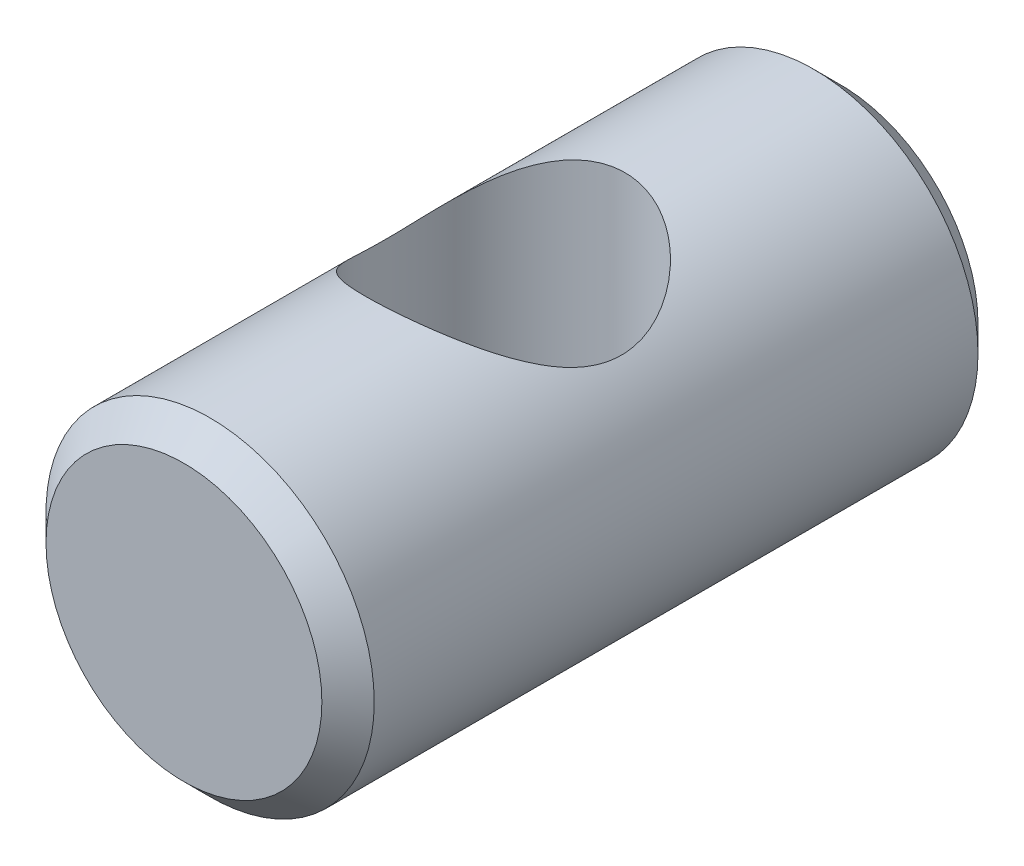
ISO-10303-21;
HEADER;
FILE_DESCRIPTION(('STEP AP214'),'2;1');
FILE_NAME('part.step','',(''),(''),'','','');
FILE_SCHEMA(('AUTOMOTIVE_DESIGN { 1 0 10303 214 1 1 1 1 }'));
ENDSEC;
DATA;
#1=APPLICATION_CONTEXT('core data for automotive mechanical design processes');
#2=APPLICATION_PROTOCOL_DEFINITION('international standard','automotive_design',2000,#1);
#3=PRODUCT_CONTEXT('',#1,'mechanical');
#4=PRODUCT('Part','Part','',(#3));
#5=PRODUCT_RELATED_PRODUCT_CATEGORY('part','',(#4));
#6=PRODUCT_DEFINITION_FORMATION('','',#4);
#7=PRODUCT_DEFINITION_CONTEXT('part definition',#1,'design');
#8=PRODUCT_DEFINITION('design','',#6,#7);
#9=PRODUCT_DEFINITION_SHAPE('','',#8);
#10=(LENGTH_UNIT() NAMED_UNIT(*) SI_UNIT(.MILLI.,.METRE.));
#11=(NAMED_UNIT(*) PLANE_ANGLE_UNIT() SI_UNIT($,.RADIAN.));
#12=(NAMED_UNIT(*) SI_UNIT($,.STERADIAN.) SOLID_ANGLE_UNIT());
#13=UNCERTAINTY_MEASURE_WITH_UNIT(LENGTH_MEASURE(1.E-05),#10,'distance_accuracy_value','');
#14=(GEOMETRIC_REPRESENTATION_CONTEXT(3) GLOBAL_UNCERTAINTY_ASSIGNED_CONTEXT((#13)) GLOBAL_UNIT_ASSIGNED_CONTEXT((#10,
#11,#12)) REPRESENTATION_CONTEXT('',''));
#15=CARTESIAN_POINT('',(0.,0.,0.));
#16=DIRECTION('',(0.,0.,1.));
#17=DIRECTION('',(1.,0.,0.));
#18=AXIS2_PLACEMENT_3D('',#15,#16,#17);
#19=CARTESIAN_POINT('',(0.,0.,9.525));
#20=DIRECTION('',(0.,0.,-1.));
#21=DIRECTION('',(-1.,0.,0.));
#22=AXIS2_PLACEMENT_3D('',#19,#20,#21);
#23=CYLINDRICAL_SURFACE('',#22,4.765);
#24=CARTESIAN_POINT('',(0.,-4.765,-3.42087708051605));
#25=CARTESIAN_POINT('',(-0.0833627581168181,-4.76499971011089,-3.42696899134864));
#26=CARTESIAN_POINT('',(-0.166953392424251,-4.76280757869707,-3.43001003086424));
#27=CARTESIAN_POINT('',(-0.333933182408652,-4.75402028790231,-3.4299899120654));
#28=CARTESIAN_POINT('',(-0.41732223719261,-4.74742325494959,-3.42692615604904));
#29=CARTESIAN_POINT('',(-0.583312250165056,-4.72989865727235,-3.41478160746824));
#30=CARTESIAN_POINT('',(-0.665912068503747,-4.71896558414041,-3.40569315136156));
#31=CARTESIAN_POINT('',(-0.829610597514771,-4.69295834085159,-3.38168739143667));
#32=CARTESIAN_POINT('',(-0.91070865358331,-4.67788240819801,-3.36676760565251));
#33=CARTESIAN_POINT('',(-1.15000632689336,-4.62699847385246,-3.31382161536754));
#34=CARTESIAN_POINT('',(-1.30524951697123,-4.58542013528299,-3.26752778272676));
#35=CARTESIAN_POINT('',(-1.60411463212557,-4.48962808746058,-3.15544383432779));
#36=CARTESIAN_POINT('',(-1.74773682156028,-4.43541466574349,-3.08965416222603));
#37=CARTESIAN_POINT('',(-2.03259497643689,-4.31273538578719,-2.93522566350036));
#38=CARTESIAN_POINT('',(-2.17272279857911,-4.24347672491827,-2.84518090003159));
#39=CARTESIAN_POINT('',(-2.43631552731587,-4.09784606286129,-2.64803347355049));
#40=CARTESIAN_POINT('',(-2.55976291960052,-4.02146672501527,-2.54091313456509));
#41=CARTESIAN_POINT('',(-2.81327393100644,-3.84950291536883,-2.28757037498761));
#42=CARTESIAN_POINT('',(-2.93940806717613,-3.75321839663727,-2.13784494064544));
#43=CARTESIAN_POINT('',(-3.10885207016274,-3.61188607024724,-1.89774924473951));
#44=CARTESIAN_POINT('',(-3.16205944901992,-3.56527135977744,-1.81509327318893));
#45=CARTESIAN_POINT('',(-3.26165283895997,-3.47438917550769,-1.64456461914389));
#46=CARTESIAN_POINT('',(-3.30804141803447,-3.43012082209568,-1.55669391813204));
#47=CARTESIAN_POINT('',(-3.41144333221737,-3.32784018306176,-1.33801732923479));
#48=CARTESIAN_POINT('',(-3.46485738281701,-3.27176419567389,-1.20454764001565));
#49=CARTESIAN_POINT('',(-3.55539465585279,-3.1731532714438,-0.92756721927326));
#50=CARTESIAN_POINT('',(-3.59255605597934,-3.13058666617785,-0.784080947165174));
#51=CARTESIAN_POINT('',(-3.64343651296181,-3.07113542283653,-0.514646140223211));
#52=CARTESIAN_POINT('',(-3.66010628533956,-3.05107413064413,-0.389980532152305));
#53=CARTESIAN_POINT('',(-3.67954153570878,-3.02761567970702,-0.138051441971632));
#54=CARTESIAN_POINT('',(-3.68232117171679,-3.02420155283186,-0.0107907379518669));
#55=CARTESIAN_POINT('',(-3.67376621747767,-3.03458366659267,0.242449329866104));
#56=CARTESIAN_POINT('',(-3.66243797397314,-3.04837216824954,0.368429244158407));
#57=CARTESIAN_POINT('',(-3.62657095184853,-3.09094772918141,0.615927376424315));
#58=CARTESIAN_POINT('',(-3.60201250089043,-3.11975712134958,0.73743866171983));
#59=CARTESIAN_POINT('',(-3.52797021750045,-3.20358122773374,1.02486117239319));
#60=CARTESIAN_POINT('',(-3.47231020523667,-3.26453704351351,1.18741075414518));
#61=CARTESIAN_POINT('',(-3.34017866781708,-3.39961296516166,1.498121783823));
#62=CARTESIAN_POINT('',(-3.2636446149314,-3.47377238661047,1.64623815847782));
#63=CARTESIAN_POINT('',(-3.12200897105521,-3.60054284241464,1.87825971607124));
#64=CARTESIAN_POINT('',(-3.06234750531042,-3.65156363596668,1.9664324955114));
#65=CARTESIAN_POINT('',(-2.93536296354977,-3.75440484501344,2.13658829521523));
#66=CARTESIAN_POINT('',(-2.86803758566651,-3.80622549668557,2.21856944344932));
#67=CARTESIAN_POINT('',(-2.65493557738645,-3.96070606463684,2.4548169203279));
#68=CARTESIAN_POINT('',(-2.49782379852181,-4.06258137631192,2.59972905493882));
#69=CARTESIAN_POINT('',(-2.18575837138569,-4.23718725327564,2.83706621766583));
#70=CARTESIAN_POINT('',(-2.03548298499758,-4.31186637762032,2.93424360521689));
#71=CARTESIAN_POINT('',(-1.71702572980925,-4.44824656330391,3.10568912436017));
#72=CARTESIAN_POINT('',(-1.54887024912961,-4.50996636079322,3.17999040299218));
#73=CARTESIAN_POINT('',(-1.22389848309853,-4.60778480850806,3.29263516387729));
#74=CARTESIAN_POINT('',(-1.06910753325384,-4.64632732736096,3.33468022800881));
#75=CARTESIAN_POINT('',(-0.752190984217973,-4.70801774696666,3.39687013419293));
#76=CARTESIAN_POINT('',(-0.59006911276469,-4.73117337991453,3.4170259792185));
#77=CARTESIAN_POINT('',(-0.262598143568305,-4.7606051003247,3.43390286080124));
#78=CARTESIAN_POINT('',(-0.0972412962651665,-4.76683385814853,3.43055828056669));
#79=CARTESIAN_POINT('',(0.23102412935329,-4.76222706928004,3.40010195996678));
#80=CARTESIAN_POINT('',(0.393932420256083,-4.75138953488968,3.37298745129903));
#81=CARTESIAN_POINT('',(0.705514268669746,-4.71498049061455,3.2979508357131));
#82=CARTESIAN_POINT('',(0.854498752183592,-4.69006694126301,3.25098003249397));
#83=CARTESIAN_POINT('',(1.14256413370517,-4.62833634686259,3.13840780618742));
#84=CARTESIAN_POINT('',(1.28164310390504,-4.59151699239253,3.07280276883643));
#85=CARTESIAN_POINT('',(1.5605913242394,-4.50478911028579,2.91796402171938));
#86=CARTESIAN_POINT('',(1.6992420339739,-4.45396042558585,2.82706121692328));
#87=CARTESIAN_POINT('',(1.96045324775841,-4.34533105232053,2.62789389216064));
#88=CARTESIAN_POINT('',(2.08299871660834,-4.28752394420402,2.51961335554432));
#89=CARTESIAN_POINT('',(2.33061071233595,-4.15886196775128,2.26753986981795));
#90=CARTESIAN_POINT('',(2.45245602746959,-4.08747815085455,2.12084350362776));
#91=CARTESIAN_POINT('',(2.67091966387116,-3.94818744226299,1.80818256348861));
#92=CARTESIAN_POINT('',(2.76753692468301,-3.88028069682256,1.64221717999395));
#93=CARTESIAN_POINT('',(2.91829752704228,-3.76775877390235,1.32363316444147));
#94=CARTESIAN_POINT('',(2.97693831230802,-3.72114907301219,1.17388770573105));
#95=CARTESIAN_POINT('',(3.04915600293589,-3.66180847873486,0.941826581338295));
#96=CARTESIAN_POINT('',(3.07060089781089,-3.64379412637323,0.863255129060437));
#97=CARTESIAN_POINT('',(3.10797188341903,-3.61197174564401,0.703992654043791));
#98=CARTESIAN_POINT('',(3.12390068817333,-3.59816164910817,0.623302694735674));
#99=CARTESIAN_POINT('',(3.15010468685879,-3.57524455910332,0.459495462666018));
#100=CARTESIAN_POINT('',(3.16032158062367,-3.5661861203942,0.376361962516616));
#101=CARTESIAN_POINT('',(3.17464168800661,-3.55344451616001,0.209195138832913));
#102=CARTESIAN_POINT('',(3.17874788699032,-3.54975872585817,0.125162274904957));
#103=CARTESIAN_POINT('',(3.18076053743013,-3.54795587812489,-0.0430393452037649));
#104=CARTESIAN_POINT('',(3.17866722999483,-3.54983860412504,-0.127208095972434));
#105=CARTESIAN_POINT('',(3.16833758034575,-3.55905933774995,-0.294840628996077));
#106=CARTESIAN_POINT('',(3.16010150131517,-3.56639711165655,-0.378304441298765));
#107=CARTESIAN_POINT('',(3.129430196119,-3.59341005189328,-0.604314657609783));
#108=CARTESIAN_POINT('',(3.10101793603989,-3.61818171011667,-0.745494317394033));
#109=CARTESIAN_POINT('',(3.02771937958645,-3.67972750014127,-1.0206998312674));
#110=CARTESIAN_POINT('',(2.98281650470617,-3.71651370639188,-1.1547183301723));
#111=CARTESIAN_POINT('',(2.8560768918245,-3.8153502491925,-1.46853642894096));
#112=CARTESIAN_POINT('',(2.76664814536404,-3.88152734494911,-1.64398166227299));
#113=CARTESIAN_POINT('',(2.56077346334119,-4.02033820070584,-1.97551522842483));
#114=CARTESIAN_POINT('',(2.44428083509274,-4.09298298410993,-2.13156938380248));
#115=CARTESIAN_POINT('',(2.18450650401399,-4.23739705669269,-2.42421216807333));
#116=CARTESIAN_POINT('',(2.04090097393914,-4.30914323590253,-2.56052605726514));
#117=CARTESIAN_POINT('',(1.7297305852206,-4.44318432752426,-2.80802181758102));
#118=CARTESIAN_POINT('',(1.56219804304704,-4.50549175797244,-2.91923707314102));
#119=CARTESIAN_POINT('',(1.23969583506405,-4.60338031575656,-3.09396462152008));
#120=CARTESIAN_POINT('',(1.08834922542924,-4.64178783933997,-3.16252149709776));
#121=CARTESIAN_POINT('',(0.853387810710921,-4.68864069192958,-3.24875451241662));
#122=CARTESIAN_POINT('',(0.773800863355171,-4.70245945854321,-3.27471971164357));
#123=CARTESIAN_POINT('',(0.612411306870999,-4.72618391319332,-3.32087000112459));
#124=CARTESIAN_POINT('',(0.53060967946606,-4.73609130567107,-3.34105760799584));
#125=CARTESIAN_POINT('',(0.374335243630178,-4.75084997254152,-3.37353939001354));
#126=CARTESIAN_POINT('',(0.300030947704159,-4.75613339853629,-3.38645258471521));
#127=CARTESIAN_POINT('',(0.150546671086999,-4.76320900575073,-3.40736829831093));
#128=CARTESIAN_POINT('',(0.0753664637160971,-4.76500026208246,-3.41536951590209));
#129=CARTESIAN_POINT('',(0.,-4.765,-3.42087708051605));
#130=B_SPLINE_CURVE_WITH_KNOTS('',3,(#24,#25,#26,#27,#28,#29,#30,#31,#32,#33,#34,#35,#36,#37,
#38,#39,#40,#41,#42,#43,#44,#45,#46,#47,#48,#49,#50,#51,#52,#53,#54,#55,#56,#57,#58,#59,#60,#61,
#62,#63,#64,#65,#66,#67,#68,#69,#70,#71,#72,#73,#74,#75,#76,#77,#78,#79,#80,#81,#82,#83,#84,#85,
#86,#87,#88,#89,#90,#91,#92,#93,#94,#95,#96,#97,#98,#99,#100,#101,#102,#103,#104,#105,#106,#107,
#108,#109,#110,#111,#112,#113,#114,#115,#116,#117,#118,#119,#120,#121,#122,#123,#124,#125,#126,
#127,#128,#129),.UNSPECIFIED.,.T.,.F.,(4,2,2,2,2,2,2,2,2,2,2,2,2,2,2,2,2,2,2,2,2,2,2,2,2,2,2,2,
2,2,2,2,2,2,2,2,2,2,2,2,2,2,2,2,2,2,2,2,2,2,2,2,4),(0.,0.250678148817341,0.501462988541287,
0.752567445437252,1.00377889552888,1.50309474088369,2.00239922444642,2.54160992918404,
3.08138247258981,3.73300244855075,4.05909733145616,4.38506908912952,4.84654436743379,
5.30692973453839,5.68734604359481,6.06737452056514,6.44723209503533,6.82765605484285,
7.37157480546313,7.91714109472133,8.27090631470675,8.62477807035776,9.33119791439566,
9.91077027397039,10.4894988486046,10.9822712500665,11.4747958366297,11.9686961727678,
12.4626540373564,12.9352342359093,13.4079061579591,13.9261848288361,14.4449439577641,
15.0533142145202,15.6617100398795,16.1619385675779,16.4119146790501,16.6617676221917,
16.9141262556176,17.1663615593023,17.4185870532858,17.6708017414467,18.1072101440206,
18.5440584873629,19.1640002904501,19.7850197135797,20.4139885307568,21.0421157411608,
21.5513660687497,21.8056438515067,22.059810706191,22.2863833912941,22.5130160751694),.UNSPECIFIED.);
#131=CARTESIAN_POINT('',(0.,-4.765,-3.42087708051605));
#132=VERTEX_POINT('',#131);
#133=EDGE_CURVE('E10',#132,#132,#130,.T.);
#134=ORIENTED_EDGE('',*,*,#133,.T.);
#135=EDGE_LOOP('',(#134));
#136=FACE_BOUND('',#135,.T.);
#137=CARTESIAN_POINT('',(-0.25,4.75843724346555,3.43));
#138=CARTESIAN_POINT('',(-0.422180009069406,4.749390618167,3.42999980483541));
#139=CARTESIAN_POINT('',(-0.59386282730199,4.73091871113112,3.41695856293195));
#140=CARTESIAN_POINT('',(-0.930629104770302,4.67635636796384,3.36610979440147));
#141=CARTESIAN_POINT('',(-1.09570851357914,4.64025529237457,3.32828730721862));
#142=CARTESIAN_POINT('',(-1.41392411864396,4.55336447971862,3.23075051942857));
#143=CARTESIAN_POINT('',(-1.56712334101048,4.5026601113221,3.17116292636266));
#144=CARTESIAN_POINT('',(-1.85998836726663,4.38979766700268,3.03299834240104));
#145=CARTESIAN_POINT('',(-1.99965414606241,4.32763956984277,2.95442131629586));
#146=CARTESIAN_POINT('',(-2.27820698899914,4.18828982189439,2.77162910883962));
#147=CARTESIAN_POINT('',(-2.41542819149111,4.11020218068903,2.66557505303866));
#148=CARTESIAN_POINT('',(-2.67111072919315,3.94883137284482,2.43572487373919));
#149=CARTESIAN_POINT('',(-2.78953546002451,3.86553849846079,2.31189500490524));
#150=CARTESIAN_POINT('',(-2.96344629098398,3.732292646302,2.10063521621267));
#151=CARTESIAN_POINT('',(-3.02522112465854,3.68226630299909,2.01833701427756));
#152=CARTESIAN_POINT('',(-3.14150590868554,3.58357003530251,1.84790207991889));
#153=CARTESIAN_POINT('',(-3.1960131207988,3.5349006275963,1.7597631654945));
#154=CARTESIAN_POINT('',(-3.29731229261899,3.44060115304685,1.57784833521895));
#155=CARTESIAN_POINT('',(-3.34411822611588,3.39496567295495,1.48408305992192));
#156=CARTESIAN_POINT('',(-3.42959137880208,3.30859742398811,1.29083456033672));
#157=CARTESIAN_POINT('',(-3.46826509160405,3.2678607546062,1.19135597958454));
#158=CARTESIAN_POINT('',(-3.54347659526858,3.18632211811376,0.96671232869286));
#159=CARTESIAN_POINT('',(-3.57812346664731,3.14705996480953,0.840323998552468));
#160=CARTESIAN_POINT('',(-3.63302442402354,3.08352956814293,0.580976208361932));
#161=CARTESIAN_POINT('',(-3.65331272726122,3.05922569654856,0.448033183521056));
#162=CARTESIAN_POINT('',(-3.67812283683354,3.02936636632518,0.17733754942323));
#163=CARTESIAN_POINT('',(-3.68251233934075,3.02396824643502,0.0395541719109336));
#164=CARTESIAN_POINT('',(-3.67470644643728,3.03344305810687,-0.23487587460697));
#165=CARTESIAN_POINT('',(-3.66249943392474,3.04833018879986,-0.371521679960182));
#166=CARTESIAN_POINT('',(-3.62015799382368,3.09852315491188,-0.655828380639311));
#167=CARTESIAN_POINT('',(-3.58799174144691,3.13612809889826,-0.802759414360213));
#168=CARTESIAN_POINT('',(-3.50660899556505,3.22685391573891,-1.08690765852794));
#169=CARTESIAN_POINT('',(-3.45734815065714,3.28001509196861,-1.22409847190397));
#170=CARTESIAN_POINT('',(-3.35999029035731,3.37921222953507,-1.45031682658415));
#171=CARTESIAN_POINT('',(-3.31552748835514,3.42299124550292,-1.54196683547208));
#172=CARTESIAN_POINT('',(-3.21937168211258,3.51357799533849,-1.7198719105116));
#173=CARTESIAN_POINT('',(-3.16767569861283,3.56038697291961,-1.80612473233374));
#174=CARTESIAN_POINT('',(-3.05733519065029,3.655577234441,-1.97327341136436));
#175=CARTESIAN_POINT('',(-2.99868376029761,3.70396004583247,-2.05416381804876));
#176=CARTESIAN_POINT('',(-2.87465956601933,3.80102084509467,-2.21043246978884));
#177=CARTESIAN_POINT('',(-2.80928649472037,3.84969884636826,-2.28581046249784));
#178=CARTESIAN_POINT('',(-2.6702557671566,3.94744940552613,-2.43263894546763));
#179=CARTESIAN_POINT('',(-2.59643405525365,3.99650228404323,-2.50394748039488));
#180=CARTESIAN_POINT('',(-2.44198609531555,4.09270177982323,-2.64020867362414));
#181=CARTESIAN_POINT('',(-2.36135999487914,4.13984843840248,-2.70516146972696));
#182=CARTESIAN_POINT('',(-2.19361254846785,4.2311207520192,-2.82808330517596));
#183=CARTESIAN_POINT('',(-2.10650409604225,4.27525208591359,-2.88606563800174));
#184=CARTESIAN_POINT('',(-1.92594548966524,4.3595756679867,-2.99452956360935));
#185=CARTESIAN_POINT('',(-1.8324951446076,4.39976779737237,-3.04501093021117));
#186=CARTESIAN_POINT('',(-1.58991791011193,4.49465680101692,-3.16160717844564));
#187=CARTESIAN_POINT('',(-1.43688887677842,4.54617300319558,-3.22239703143537));
#188=CARTESIAN_POINT('',(-1.11985321098478,4.63445714602499,-3.3220213557935));
#189=CARTESIAN_POINT('',(-0.955854490731872,4.67123558567514,-3.36087146486794));
#190=CARTESIAN_POINT('',(-0.620041304864634,4.72756501903715,-3.41423360193657));
#191=CARTESIAN_POINT('',(-0.448189976813922,4.74702354164412,-3.42861536060857));
#192=CARTESIAN_POINT('',(-0.103195532056557,4.76701209164517,-3.43119218349009));
#193=CARTESIAN_POINT('',(0.0699472713914494,4.76754656888776,-3.41939340455174));
#194=CARTESIAN_POINT('',(0.396800733953035,4.75102741592386,-3.37216085402572));
#195=CARTESIAN_POINT('',(0.550903795546914,4.73547935394817,-3.33884247322146));
#196=CARTESIAN_POINT('',(0.851262679297081,4.69080460019725,-3.25216372524372));
#197=CARTESIAN_POINT('',(0.997516834516371,4.66167503663273,-3.19879911978834));
#198=CARTESIAN_POINT('',(1.28614476637547,4.59066745677348,-3.0710403225626));
#199=CARTESIAN_POINT('',(1.42797966766526,4.5482360225696,-2.99574591149816));
#200=CARTESIAN_POINT('',(1.69771873358212,4.45459184021555,-2.82781924377908));
#201=CARTESIAN_POINT('',(1.8256191613735,4.40337674596602,-2.73518235437366));
#202=CARTESIAN_POINT('',(2.08559098582612,4.28706511495821,-2.51852707855975));
#203=CARTESIAN_POINT('',(2.21504202441681,4.22105957781513,-2.39185853378127));
#204=CARTESIAN_POINT('',(2.4525288591269,4.08765163666692,-2.11988296233599));
#205=CARTESIAN_POINT('',(2.56051870491995,4.02024656957631,-1.97453701758846));
#206=CARTESIAN_POINT('',(2.71141297716131,3.91890470250435,-1.73364032653499));
#207=CARTESIAN_POINT('',(2.76225962831151,3.88310759046257,-1.64375989611526));
#208=CARTESIAN_POINT('',(2.85606768069206,3.81463871939836,-1.45876664530863));
#209=CARTESIAN_POINT('',(2.8990272649147,3.78196768138302,-1.36365262576038));
#210=CARTESIAN_POINT('',(2.97638382467227,3.7213945324715,-1.16888238761678));
#211=CARTESIAN_POINT('',(3.01080676435227,3.69347804384769,-1.06924106056856));
#212=CARTESIAN_POINT('',(3.07061216797024,3.64390866973889,-0.865836413850729));
#213=CARTESIAN_POINT('',(3.09600079900905,3.62225151334222,-0.762075960014789));
#214=CARTESIAN_POINT('',(3.14431905107756,3.58048576732931,-0.514276109849917));
#215=CARTESIAN_POINT('',(3.1632690781055,3.56357947310397,-0.368863877264378));
#216=CARTESIAN_POINT('',(3.18229415057448,3.54660528363273,-0.0759553160984819));
#217=CARTESIAN_POINT('',(3.18238833621043,3.54652031339164,0.0715387471135849));
#218=CARTESIAN_POINT('',(3.16376347579515,3.56313911837427,0.364127843469744));
#219=CARTESIAN_POINT('',(3.14506985693007,3.57982020262542,0.509225849632987));
#220=CARTESIAN_POINT('',(3.09006178812862,3.6274007096972,0.79369467897637));
#221=CARTESIAN_POINT('',(3.05372153995533,3.65832094581284,0.933056792070449));
#222=CARTESIAN_POINT('',(2.94995679839854,3.74283457822027,1.249627259653));
#223=CARTESIAN_POINT('',(2.87616913174531,3.80056128592335,1.42363336901505));
#224=CARTESIAN_POINT('',(2.70309172031867,3.9255469405295,1.75476054116614));
#225=CARTESIAN_POINT('',(2.60375916203549,3.99282180458683,1.91185262262683));
#226=CARTESIAN_POINT('',(2.37965965281677,4.13038218124549,2.21024978907531));
#227=CARTESIAN_POINT('',(2.25446848393284,4.20070005001654,2.35122119961122));
#228=CARTESIAN_POINT('',(1.98132226028617,4.33621841215064,2.61183089931649));
#229=CARTESIAN_POINT('',(1.83339056066264,4.40142405331531,2.73149080683867));
#230=CARTESIAN_POINT('',(1.53413492006617,4.51378899534322,2.93439863762913));
#231=CARTESIAN_POINT('',(1.38501302638155,4.56214832085995,3.02021473285691));
#232=CARTESIAN_POINT('',(1.07249564524744,4.64554146755817,3.16951406225263));
#233=CARTESIAN_POINT('',(0.909111289256099,4.68058556855773,3.23301452201411));
#234=CARTESIAN_POINT('',(0.581478494873654,4.73212589223905,3.33183530764178));
#235=CARTESIAN_POINT('',(0.417802064196767,4.74955942472212,3.36854686433097));
#236=CARTESIAN_POINT('',(0.0859254534274415,4.76711849433293,3.41762518536938));
#237=CARTESIAN_POINT('',(-0.0822731758795955,4.76724989098796,3.43000019011695));
#238=CARTESIAN_POINT('',(-0.25,4.75843724346555,3.43));
#239=B_SPLINE_CURVE_WITH_KNOTS('',3,(#137,#138,#139,#140,#141,#142,#143,#144,#145,#146,#147,
#148,#149,#150,#151,#152,#153,#154,#155,#156,#157,#158,#159,#160,#161,#162,#163,#164,#165,#166,
#167,#168,#169,#170,#171,#172,#173,#174,#175,#176,#177,#178,#179,#180,#181,#182,#183,#184,#185,
#186,#187,#188,#189,#190,#191,#192,#193,#194,#195,#196,#197,#198,#199,#200,#201,#202,#203,#204,
#205,#206,#207,#208,#209,#210,#211,#212,#213,#214,#215,#216,#217,#218,#219,#220,#221,#222,#223,
#224,#225,#226,#227,#228,#229,#230,#231,#232,#233,#234,#235,#236,#237,#238),.UNSPECIFIED.,.T.,
.F.,(4,2,2,2,2,2,2,2,2,2,2,2,2,2,2,2,2,2,2,2,2,2,2,2,2,2,2,2,2,2,2,2,2,2,2,2,2,2,2,2,2,2,2,2,2,
2,2,2,2,2,4),(0.,0.516551025096824,1.03341418220019,1.54731512007828,2.06121701081903,
2.62982932183038,3.19953571462131,3.54246459279583,3.88552231417978,4.22795053195656,
4.57010427222594,4.97905439316964,5.38702665221779,5.79838620186915,6.21003384012951,
6.67262967068467,7.1364347778277,7.46866532411958,7.80103311718076,8.13373371721725,
8.46644953806418,8.80733809568014,9.14821926074385,9.48843965067855,9.82867029735157,
10.3440014803113,10.8589648922706,11.3766614843259,11.8942363430695,12.3673901670618,
12.8406440841658,13.3370245096255,13.8335377244494,14.4096746680997,14.9870321881218,
15.3145391492316,15.6421214663625,15.968694875667,16.2950449261748,16.7357599059526,
17.1760275223247,17.6157000871626,18.0560173690192,18.6457302885718,19.2364380888803,
19.8377403374759,20.4384291081866,20.9723943239786,21.5059464582794,22.0093081125728,
22.5124992983782),.UNSPECIFIED.);
#240=CARTESIAN_POINT('',(-0.25,4.75843724346555,3.43));
#241=VERTEX_POINT('',#240);
#242=EDGE_CURVE('E59',#241,#241,#239,.T.);
#243=ORIENTED_EDGE('',*,*,#242,.T.);
#244=EDGE_LOOP('',(#243));
#245=FACE_BOUND('',#244,.T.);
#246=CARTESIAN_POINT('',(0.,0.,-8.76499999999999));
#247=DIRECTION('',(0.,0.,1.));
#248=DIRECTION('',(1.,0.,0.));
#249=AXIS2_PLACEMENT_3D('',#246,#247,#248);
#250=CIRCLE('',#249,4.765);
#251=CARTESIAN_POINT('',(4.765,0.,-8.76499999999999));
#252=VERTEX_POINT('',#251);
#253=EDGE_CURVE('E102',#252,#252,#250,.T.);
#254=ORIENTED_EDGE('',*,*,#253,.T.);
#255=EDGE_LOOP('',(#254));
#256=FACE_BOUND('',#255,.T.);
#257=CARTESIAN_POINT('',(0.,0.,8.76500000000001));
#258=DIRECTION('',(0.,0.,1.));
#259=DIRECTION('',(1.,0.,0.));
#260=AXIS2_PLACEMENT_3D('',#257,#258,#259);
#261=CIRCLE('',#260,4.765);
#262=CARTESIAN_POINT('',(4.765,0.,8.76500000000001));
#263=VERTEX_POINT('',#262);
#264=EDGE_CURVE('E105',#263,#263,#261,.F.);
#265=ORIENTED_EDGE('',*,*,#264,.T.);
#266=EDGE_LOOP('',(#265));
#267=FACE_BOUND('',#266,.T.);
#268=ADVANCED_FACE('F45',(#136,#245,#256,#267),#23,.T.);
#269=CARTESIAN_POINT('',(0.,0.,9.525));
#270=DIRECTION('',(0.,0.,1.));
#271=DIRECTION('',(1.,0.,0.));
#272=AXIS2_PLACEMENT_3D('',#269,#270,#271);
#273=PLANE('',#272);
#274=CARTESIAN_POINT('',(0.,0.,9.525));
#275=DIRECTION('',(0.,0.,1.));
#276=DIRECTION('',(1.,0.,0.));
#277=AXIS2_PLACEMENT_3D('',#274,#275,#276);
#278=CIRCLE('',#277,4.00500000000001);
#279=CARTESIAN_POINT('',(4.00500000000001,0.,9.525));
#280=VERTEX_POINT('',#279);
#281=EDGE_CURVE('E64',#280,#280,#278,.T.);
#282=ORIENTED_EDGE('',*,*,#281,.T.);
#283=EDGE_LOOP('',(#282));
#284=FACE_BOUND('',#283,.T.);
#285=ADVANCED_FACE('F82',(#284),#273,.T.);
#286=CARTESIAN_POINT('',(0.,0.,-9.525));
#287=DIRECTION('',(0.,0.,1.));
#288=DIRECTION('',(1.,0.,0.));
#289=AXIS2_PLACEMENT_3D('',#286,#287,#288);
#290=PLANE('',#289);
#291=CARTESIAN_POINT('',(0.,0.,-9.525));
#292=DIRECTION('',(0.,0.,1.));
#293=DIRECTION('',(1.,0.,0.));
#294=AXIS2_PLACEMENT_3D('',#291,#292,#293);
#295=CIRCLE('',#294,4.00499999999998);
#296=CARTESIAN_POINT('',(4.00499999999998,0.,-9.525));
#297=VERTEX_POINT('',#296);
#298=EDGE_CURVE('E69',#297,#297,#295,.F.);
#299=ORIENTED_EDGE('',*,*,#298,.T.);
#300=EDGE_LOOP('',(#299));
#301=FACE_BOUND('',#300,.T.);
#302=ADVANCED_FACE('F85',(#301),#290,.F.);
#303=CARTESIAN_POINT('',(0.,0.,-8.76499999999999));
#304=DIRECTION('',(0.,0.,1.));
#305=DIRECTION('',(1.,0.,0.));
#306=AXIS2_PLACEMENT_3D('',#303,#304,#305);
#307=CONICAL_SURFACE('',#306,4.765,0.78539816339745);
#308=ORIENTED_EDGE('',*,*,#298,.F.);
#309=EDGE_LOOP('',(#308));
#310=FACE_BOUND('',#309,.T.);
#311=ORIENTED_EDGE('',*,*,#253,.F.);
#312=EDGE_LOOP('',(#311));
#313=FACE_BOUND('',#312,.T.);
#314=ADVANCED_FACE('F88',(#310,#313),#307,.T.);
#315=CARTESIAN_POINT('',(0.,0.,9.525));
#316=DIRECTION('',(0.,0.,-1.));
#317=DIRECTION('',(-1.,0.,0.));
#318=AXIS2_PLACEMENT_3D('',#315,#316,#317);
#319=CONICAL_SURFACE('',#318,4.00500000000001,0.785398163397449);
#320=ORIENTED_EDGE('',*,*,#264,.F.);
#321=EDGE_LOOP('',(#320));
#322=FACE_BOUND('',#321,.T.);
#323=ORIENTED_EDGE('',*,*,#281,.F.);
#324=EDGE_LOOP('',(#323));
#325=FACE_BOUND('',#324,.T.);
#326=ADVANCED_FACE('F48',(#322,#325),#319,.T.);
#327=CARTESIAN_POINT('',(-0.25,-4.765,0.));
#328=DIRECTION('',(0.,1.,0.));
#329=DIRECTION('',(0.,0.,1.));
#330=AXIS2_PLACEMENT_3D('',#327,#328,#329);
#331=CYLINDRICAL_SURFACE('',#330,3.43);
#332=ORIENTED_EDGE('',*,*,#242,.F.);
#333=EDGE_LOOP('',(#332));
#334=FACE_BOUND('',#333,.T.);
#335=ORIENTED_EDGE('',*,*,#133,.F.);
#336=EDGE_LOOP('',(#335));
#337=FACE_BOUND('',#336,.T.);
#338=ADVANCED_FACE('F77',(#334,#337),#331,.F.);
#339=CLOSED_SHELL('',(#268,#285,#302,#314,#326,#338));
#340=MANIFOLD_SOLID_BREP('B2',#339);
#341=ADVANCED_BREP_SHAPE_REPRESENTATION('',(#18,#340),#14);
#342=SHAPE_DEFINITION_REPRESENTATION(#9,#341);
ENDSEC;
END-ISO-10303-21;
